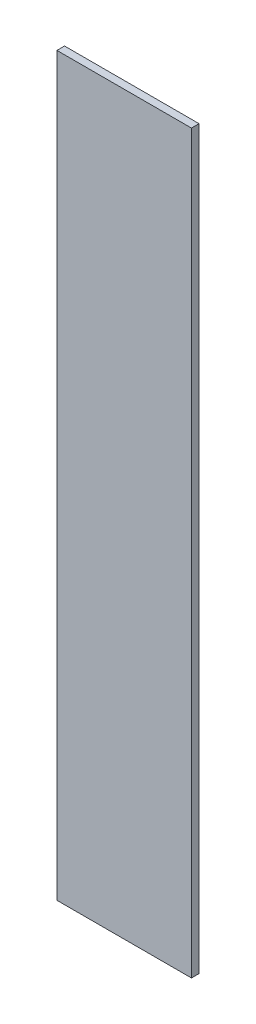
ISO-10303-21;
HEADER;
FILE_DESCRIPTION(('STEP AP214'),'2;1');
FILE_NAME('part.step','',(''),(''),'','','');
FILE_SCHEMA(('AUTOMOTIVE_DESIGN { 1 0 10303 214 1 1 1 1 }'));
ENDSEC;
DATA;
#1=APPLICATION_CONTEXT('core data for automotive mechanical design processes');
#2=APPLICATION_PROTOCOL_DEFINITION('international standard','automotive_design',2000,#1);
#3=PRODUCT_CONTEXT('',#1,'mechanical');
#4=PRODUCT('Part','Part','',(#3));
#5=PRODUCT_RELATED_PRODUCT_CATEGORY('part','',(#4));
#6=PRODUCT_DEFINITION_FORMATION('','',#4);
#7=PRODUCT_DEFINITION_CONTEXT('part definition',#1,'design');
#8=PRODUCT_DEFINITION('design','',#6,#7);
#9=PRODUCT_DEFINITION_SHAPE('','',#8);
#10=(LENGTH_UNIT() NAMED_UNIT(*) SI_UNIT(.MILLI.,.METRE.));
#11=(NAMED_UNIT(*) PLANE_ANGLE_UNIT() SI_UNIT($,.RADIAN.));
#12=(NAMED_UNIT(*) SI_UNIT($,.STERADIAN.) SOLID_ANGLE_UNIT());
#13=UNCERTAINTY_MEASURE_WITH_UNIT(LENGTH_MEASURE(1.E-05),#10,'distance_accuracy_value','');
#14=(GEOMETRIC_REPRESENTATION_CONTEXT(3) GLOBAL_UNCERTAINTY_ASSIGNED_CONTEXT((#13)) GLOBAL_UNIT_ASSIGNED_CONTEXT((#10,
#11,#12)) REPRESENTATION_CONTEXT('',''));
#15=CARTESIAN_POINT('',(0.,0.,0.));
#16=DIRECTION('',(0.,0.,1.));
#17=DIRECTION('',(1.,0.,0.));
#18=AXIS2_PLACEMENT_3D('',#15,#16,#17);
#19=CARTESIAN_POINT('',(-60.6717735217204,31.2252066115702,3.));
#20=DIRECTION('',(1.,0.,0.));
#21=DIRECTION('',(0.,1.,0.));
#22=AXIS2_PLACEMENT_3D('',#19,#20,#21);
#23=PLANE('',#22);
#24=DIRECTION('',(0.,-1.,0.));
#25=VECTOR('',#24,1.);
#26=CARTESIAN_POINT('',(-60.6717735217204,31.2252066115702,0.));
#27=LINE('',#26,#25);
#28=CARTESIAN_POINT('',(-60.6717735217204,31.2252066115702,0.));
#29=VERTEX_POINT('',#28);
#30=CARTESIAN_POINT('',(-60.6717735217204,-258.77479338843,0.));
#31=VERTEX_POINT('',#30);
#32=EDGE_CURVE('E96',#29,#31,#27,.T.);
#33=ORIENTED_EDGE('',*,*,#32,.T.);
#34=DIRECTION('',(0.,0.,-1.));
#35=VECTOR('',#34,1.);
#36=CARTESIAN_POINT('',(-60.6717735217204,-258.77479338843,3.));
#37=LINE('',#36,#35);
#38=CARTESIAN_POINT('',(-60.6717735217204,-258.77479338843,3.));
#39=VERTEX_POINT('',#38);
#40=EDGE_CURVE('E11',#39,#31,#37,.T.);
#41=ORIENTED_EDGE('',*,*,#40,.F.);
#42=DIRECTION('',(0.,-1.,0.));
#43=VECTOR('',#42,1.);
#44=CARTESIAN_POINT('',(-60.6717735217204,31.2252066115702,3.));
#45=LINE('',#44,#43);
#46=CARTESIAN_POINT('',(-60.6717735217204,31.2252066115702,3.));
#47=VERTEX_POINT('',#46);
#48=EDGE_CURVE('E84',#47,#39,#45,.T.);
#49=ORIENTED_EDGE('',*,*,#48,.F.);
#50=DIRECTION('',(0.,0.,-1.));
#51=VECTOR('',#50,1.);
#52=CARTESIAN_POINT('',(-60.6717735217204,31.2252066115702,3.));
#53=LINE('',#52,#51);
#54=EDGE_CURVE('E92',#47,#29,#53,.T.);
#55=ORIENTED_EDGE('',*,*,#54,.T.);
#56=EDGE_LOOP('',(#33,#41,#49,#55));
#57=FACE_BOUND('',#56,.T.);
#58=ADVANCED_FACE('F33',(#57),#23,.F.);
#59=CARTESIAN_POINT('',(-60.6717735217204,-258.77479338843,3.));
#60=DIRECTION('',(0.,1.,0.));
#61=DIRECTION('',(0.,0.,1.));
#62=AXIS2_PLACEMENT_3D('',#59,#60,#61);
#63=PLANE('',#62);
#64=DIRECTION('',(1.,0.,0.));
#65=VECTOR('',#64,1.);
#66=CARTESIAN_POINT('',(-60.6717735217204,-258.77479338843,0.));
#67=LINE('',#66,#65);
#68=CARTESIAN_POINT('',(-7.67177352172037,-258.77479338843,0.));
#69=VERTEX_POINT('',#68);
#70=EDGE_CURVE('E88',#31,#69,#67,.T.);
#71=ORIENTED_EDGE('',*,*,#70,.T.);
#72=DIRECTION('',(0.,0.,-1.));
#73=VECTOR('',#72,1.);
#74=CARTESIAN_POINT('',(-7.67177352172037,-258.77479338843,3.));
#75=LINE('',#74,#73);
#76=CARTESIAN_POINT('',(-7.67177352172037,-258.77479338843,3.));
#77=VERTEX_POINT('',#76);
#78=EDGE_CURVE('E41',#77,#69,#75,.T.);
#79=ORIENTED_EDGE('',*,*,#78,.F.);
#80=DIRECTION('',(1.,0.,0.));
#81=VECTOR('',#80,1.);
#82=CARTESIAN_POINT('',(-60.6717735217204,-258.77479338843,3.));
#83=LINE('',#82,#81);
#84=EDGE_CURVE('E79',#39,#77,#83,.T.);
#85=ORIENTED_EDGE('',*,*,#84,.F.);
#86=ORIENTED_EDGE('',*,*,#40,.T.);
#87=EDGE_LOOP('',(#71,#79,#85,#86));
#88=FACE_BOUND('',#87,.T.);
#89=ADVANCED_FACE('F87',(#88),#63,.F.);
#90=CARTESIAN_POINT('',(-7.6717735217204,31.2252066115702,3.));
#91=DIRECTION('',(-1.,0.,0.));
#92=DIRECTION('',(0.,-1.,0.));
#93=AXIS2_PLACEMENT_3D('',#90,#91,#92);
#94=PLANE('',#93);
#95=DIRECTION('',(0.,1.,0.));
#96=VECTOR('',#95,1.);
#97=CARTESIAN_POINT('',(-7.6717735217204,31.2252066115702,0.));
#98=LINE('',#97,#96);
#99=CARTESIAN_POINT('',(-7.6717735217204,31.2252066115702,0.));
#100=VERTEX_POINT('',#99);
#101=EDGE_CURVE('E66',#69,#100,#98,.T.);
#102=ORIENTED_EDGE('',*,*,#101,.T.);
#103=DIRECTION('',(0.,0.,-1.));
#104=VECTOR('',#103,1.);
#105=CARTESIAN_POINT('',(-7.6717735217204,31.2252066115702,3.));
#106=LINE('',#105,#104);
#107=CARTESIAN_POINT('',(-7.6717735217204,31.2252066115702,3.));
#108=VERTEX_POINT('',#107);
#109=EDGE_CURVE('E89',#108,#100,#106,.T.);
#110=ORIENTED_EDGE('',*,*,#109,.F.);
#111=DIRECTION('',(0.,1.,0.));
#112=VECTOR('',#111,1.);
#113=CARTESIAN_POINT('',(-7.6717735217204,31.2252066115702,3.));
#114=LINE('',#113,#112);
#115=EDGE_CURVE('E82',#77,#108,#114,.T.);
#116=ORIENTED_EDGE('',*,*,#115,.F.);
#117=ORIENTED_EDGE('',*,*,#78,.T.);
#118=EDGE_LOOP('',(#102,#110,#116,#117));
#119=FACE_BOUND('',#118,.T.);
#120=ADVANCED_FACE('F90',(#119),#94,.F.);
#121=CARTESIAN_POINT('',(-60.6717735217204,31.2252066115702,3.));
#122=DIRECTION('',(0.,-1.,0.));
#123=DIRECTION('',(0.,0.,-1.));
#124=AXIS2_PLACEMENT_3D('',#121,#122,#123);
#125=PLANE('',#124);
#126=DIRECTION('',(-1.,0.,0.));
#127=VECTOR('',#126,1.);
#128=CARTESIAN_POINT('',(-60.6717735217204,31.2252066115702,0.));
#129=LINE('',#128,#127);
#130=EDGE_CURVE('E72',#100,#29,#129,.T.);
#131=ORIENTED_EDGE('',*,*,#130,.T.);
#132=ORIENTED_EDGE('',*,*,#54,.F.);
#133=DIRECTION('',(-1.,0.,0.));
#134=VECTOR('',#133,1.);
#135=CARTESIAN_POINT('',(-60.6717735217204,31.2252066115702,3.));
#136=LINE('',#135,#134);
#137=EDGE_CURVE('E49',#108,#47,#136,.T.);
#138=ORIENTED_EDGE('',*,*,#137,.F.);
#139=ORIENTED_EDGE('',*,*,#109,.T.);
#140=EDGE_LOOP('',(#131,#132,#138,#139));
#141=FACE_BOUND('',#140,.T.);
#142=ADVANCED_FACE('F103',(#141),#125,.F.);
#143=CARTESIAN_POINT('',(0.,0.,3.));
#144=DIRECTION('',(0.,0.,1.));
#145=DIRECTION('',(1.,0.,0.));
#146=AXIS2_PLACEMENT_3D('',#143,#144,#145);
#147=PLANE('',#146);
#148=ORIENTED_EDGE('',*,*,#48,.T.);
#149=ORIENTED_EDGE('',*,*,#84,.T.);
#150=ORIENTED_EDGE('',*,*,#115,.T.);
#151=ORIENTED_EDGE('',*,*,#137,.T.);
#152=EDGE_LOOP('',(#148,#149,#150,#151));
#153=FACE_BOUND('',#152,.T.);
#154=ADVANCED_FACE('F80',(#153),#147,.T.);
#155=CARTESIAN_POINT('',(0.,0.,0.));
#156=DIRECTION('',(0.,0.,1.));
#157=DIRECTION('',(1.,0.,0.));
#158=AXIS2_PLACEMENT_3D('',#155,#156,#157);
#159=PLANE('',#158);
#160=ORIENTED_EDGE('',*,*,#32,.F.);
#161=ORIENTED_EDGE('',*,*,#130,.F.);
#162=ORIENTED_EDGE('',*,*,#101,.F.);
#163=ORIENTED_EDGE('',*,*,#70,.F.);
#164=EDGE_LOOP('',(#160,#161,#162,#163));
#165=FACE_BOUND('',#164,.T.);
#166=ADVANCED_FACE('F106',(#165),#159,.F.);
#167=CLOSED_SHELL('',(#58,#89,#120,#142,#154,#166));
#168=MANIFOLD_SOLID_BREP('B2',#167);
#169=ADVANCED_BREP_SHAPE_REPRESENTATION('',(#18,#168),#14);
#170=SHAPE_DEFINITION_REPRESENTATION(#9,#169);
ENDSEC;
END-ISO-10303-21;
